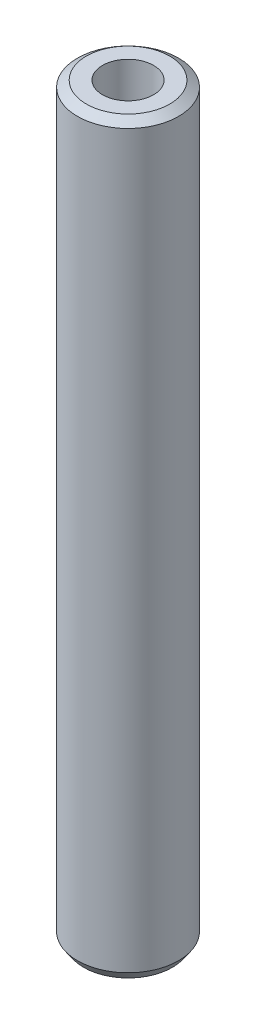
ISO-10303-21;
HEADER;
FILE_DESCRIPTION(('STEP AP214'),'2;1');
FILE_NAME('part.step','',(''),(''),'','','');
FILE_SCHEMA(('AUTOMOTIVE_DESIGN { 1 0 10303 214 1 1 1 1 }'));
ENDSEC;
DATA;
#1=APPLICATION_CONTEXT('core data for automotive mechanical design processes');
#2=APPLICATION_PROTOCOL_DEFINITION('international standard','automotive_design',2000,#1);
#3=PRODUCT_CONTEXT('',#1,'mechanical');
#4=PRODUCT('Part','Part','',(#3));
#5=PRODUCT_RELATED_PRODUCT_CATEGORY('part','',(#4));
#6=PRODUCT_DEFINITION_FORMATION('','',#4);
#7=PRODUCT_DEFINITION_CONTEXT('part definition',#1,'design');
#8=PRODUCT_DEFINITION('design','',#6,#7);
#9=PRODUCT_DEFINITION_SHAPE('','',#8);
#10=(LENGTH_UNIT() NAMED_UNIT(*) SI_UNIT(.MILLI.,.METRE.));
#11=(NAMED_UNIT(*) PLANE_ANGLE_UNIT() SI_UNIT($,.RADIAN.));
#12=(NAMED_UNIT(*) SI_UNIT($,.STERADIAN.) SOLID_ANGLE_UNIT());
#13=UNCERTAINTY_MEASURE_WITH_UNIT(LENGTH_MEASURE(1.E-05),#10,'distance_accuracy_value','');
#14=(GEOMETRIC_REPRESENTATION_CONTEXT(3) GLOBAL_UNCERTAINTY_ASSIGNED_CONTEXT((#13)) GLOBAL_UNIT_ASSIGNED_CONTEXT((#10,
#11,#12)) REPRESENTATION_CONTEXT('',''));
#15=CARTESIAN_POINT('',(0.,0.,0.));
#16=DIRECTION('',(0.,0.,1.));
#17=DIRECTION('',(1.,0.,0.));
#18=AXIS2_PLACEMENT_3D('',#15,#16,#17);
#19=CARTESIAN_POINT('',(0.,73.8165123304939,0.));
#20=DIRECTION('',(0.,-1.,0.));
#21=DIRECTION('',(0.,0.,-1.));
#22=AXIS2_PLACEMENT_3D('',#19,#20,#21);
#23=CYLINDRICAL_SURFACE('',#22,5.);
#24=CARTESIAN_POINT('',(0.,73.2033492976956,0.));
#25=DIRECTION('',(0.,1.,0.));
#26=DIRECTION('',(0.,0.,1.));
#27=AXIS2_PLACEMENT_3D('',#24,#25,#26);
#28=CIRCLE('',#27,5.);
#29=CARTESIAN_POINT('',(0.,73.2033492976956,-5.00000000000001));
#30=VERTEX_POINT('',#29);
#31=EDGE_CURVE('E50',#30,#30,#28,.F.);
#32=ORIENTED_EDGE('',*,*,#31,.T.);
#33=EDGE_LOOP('',(#32));
#34=FACE_BOUND('',#33,.T.);
#35=CARTESIAN_POINT('',(0.,0.881076495948374,0.));
#36=DIRECTION('',(0.,1.,0.));
#37=DIRECTION('',(0.,0.,1.));
#38=AXIS2_PLACEMENT_3D('',#35,#36,#37);
#39=CIRCLE('',#38,5.);
#40=CARTESIAN_POINT('',(0.,0.881076495948374,5.));
#41=VERTEX_POINT('',#40);
#42=EDGE_CURVE('E51',#41,#41,#39,.T.);
#43=ORIENTED_EDGE('',*,*,#42,.T.);
#44=EDGE_LOOP('',(#43));
#45=FACE_BOUND('',#44,.T.);
#46=ADVANCED_FACE('F39',(#34,#45),#23,.T.);
#47=CARTESIAN_POINT('',(0.,73.8165123304939,0.));
#48=DIRECTION('',(0.,1.,0.));
#49=DIRECTION('',(0.,0.,1.));
#50=AXIS2_PLACEMENT_3D('',#47,#48,#49);
#51=PLANE('',#50);
#52=CARTESIAN_POINT('',(0.,73.8165123304939,0.));
#53=DIRECTION('',(0.,1.,0.));
#54=DIRECTION('',(0.,0.,1.));
#55=AXIS2_PLACEMENT_3D('',#52,#53,#54);
#56=CIRCLE('',#55,4.1189235040516);
#57=CARTESIAN_POINT('',(0.,73.8165123304939,-4.11892350405161));
#58=VERTEX_POINT('',#57);
#59=EDGE_CURVE('E54',#58,#58,#56,.T.);
#60=ORIENTED_EDGE('',*,*,#59,.T.);
#61=EDGE_LOOP('',(#60));
#62=FACE_BOUND('',#61,.T.);
#63=CARTESIAN_POINT('',(0.,73.8165123304939,0.));
#64=DIRECTION('',(0.,1.,0.));
#65=DIRECTION('',(0.,0.,1.));
#66=AXIS2_PLACEMENT_3D('',#63,#64,#65);
#67=CIRCLE('',#66,2.52260098917217);
#68=CARTESIAN_POINT('',(0.,73.8165123304939,2.52260098917217));
#69=VERTEX_POINT('',#68);
#70=EDGE_CURVE('E58',#69,#69,#67,.T.);
#71=ORIENTED_EDGE('',*,*,#70,.F.);
#72=EDGE_LOOP('',(#71));
#73=FACE_BOUND('',#72,.T.);
#74=ADVANCED_FACE('F69',(#62,#73),#51,.T.);
#75=CARTESIAN_POINT('',(0.,0.,0.));
#76=DIRECTION('',(0.,1.,0.));
#77=DIRECTION('',(0.,0.,1.));
#78=AXIS2_PLACEMENT_3D('',#75,#76,#77);
#79=PLANE('',#78);
#80=CARTESIAN_POINT('',(0.,0.,0.));
#81=DIRECTION('',(0.,1.,0.));
#82=DIRECTION('',(0.,0.,1.));
#83=AXIS2_PLACEMENT_3D('',#80,#81,#82);
#84=CIRCLE('',#83,4.38683696720161);
#85=CARTESIAN_POINT('',(0.,0.,4.38683696720161));
#86=VERTEX_POINT('',#85);
#87=EDGE_CURVE('E10',#86,#86,#84,.F.);
#88=ORIENTED_EDGE('',*,*,#87,.T.);
#89=EDGE_LOOP('',(#88));
#90=FACE_BOUND('',#89,.T.);
#91=CARTESIAN_POINT('',(0.,0.,0.));
#92=DIRECTION('',(0.,1.,0.));
#93=DIRECTION('',(0.,0.,1.));
#94=AXIS2_PLACEMENT_3D('',#91,#92,#93);
#95=CIRCLE('',#94,2.52260098917217);
#96=CARTESIAN_POINT('',(0.,0.,2.52260098917217));
#97=VERTEX_POINT('',#96);
#98=EDGE_CURVE('E63',#97,#97,#95,.T.);
#99=ORIENTED_EDGE('',*,*,#98,.T.);
#100=EDGE_LOOP('',(#99));
#101=FACE_BOUND('',#100,.T.);
#102=ADVANCED_FACE('F75',(#90,#101),#79,.F.);
#103=CARTESIAN_POINT('',(0.,73.8165123304939,0.));
#104=DIRECTION('',(0.,-1.,0.));
#105=DIRECTION('',(0.,0.,-1.));
#106=AXIS2_PLACEMENT_3D('',#103,#104,#105);
#107=CYLINDRICAL_SURFACE('',#106,2.52260098917217);
#108=ORIENTED_EDGE('',*,*,#70,.T.);
#109=EDGE_LOOP('',(#108));
#110=FACE_BOUND('',#109,.T.);
#111=ORIENTED_EDGE('',*,*,#98,.F.);
#112=EDGE_LOOP('',(#111));
#113=FACE_BOUND('',#112,.T.);
#114=ADVANCED_FACE('F70',(#110,#113),#107,.F.);
#115=CARTESIAN_POINT('',(0.,73.8165123304939,0.));
#116=DIRECTION('',(0.,-1.,0.));
#117=DIRECTION('',(0.,0.,-1.));
#118=AXIS2_PLACEMENT_3D('',#115,#116,#117);
#119=CONICAL_SURFACE('',#118,4.1189235040516,0.962810598294387);
#120=CARTESIAN_POINT('',(0.,73.2033492976956,-5.00000000000001));
#121=CARTESIAN_POINT('',(0.,73.2097364126205,-4.99082211983388));
#122=CARTESIAN_POINT('',(0.,73.2161235275455,-4.98164423966775));
#123=CARTESIAN_POINT('',(0.,73.2288977573955,-4.96328847933549));
#124=CARTESIAN_POINT('',(0.,73.2352848723205,-4.95411059916936));
#125=CARTESIAN_POINT('',(0.,73.2480591021704,-4.93575483883711));
#126=CARTESIAN_POINT('',(0.,73.2544462170954,-4.92657695867098));
#127=CARTESIAN_POINT('',(0.,73.2672204469454,-4.90822119833872));
#128=CARTESIAN_POINT('',(0.,73.2736075618704,-4.89904331817259));
#129=CARTESIAN_POINT('',(0.,73.2863817917203,-4.88068755784033));
#130=CARTESIAN_POINT('',(0.,73.2927689066453,-4.8715096776742));
#131=CARTESIAN_POINT('',(0.,73.3055431364953,-4.85315391734194));
#132=CARTESIAN_POINT('',(0.,73.3119302514203,-4.84397603717581));
#133=CARTESIAN_POINT('',(0.,73.3247044812702,-4.82562027684356));
#134=CARTESIAN_POINT('',(0.,73.3310915961952,-4.81644239667743));
#135=CARTESIAN_POINT('',(0.,73.3438658260452,-4.79808663634517));
#136=CARTESIAN_POINT('',(0.,73.3502529409702,-4.78890875617904));
#137=CARTESIAN_POINT('',(0.,73.3630271708201,-4.77055299584678));
#138=CARTESIAN_POINT('',(0.,73.3694142857451,-4.76137511568065));
#139=CARTESIAN_POINT('',(0.,73.3821885155951,-4.74301935534839));
#140=CARTESIAN_POINT('',(0.,73.3885756305201,-4.73384147518226));
#141=CARTESIAN_POINT('',(0.,73.40134986037,-4.71548571485001));
#142=CARTESIAN_POINT('',(0.,73.407736975295,-4.70630783468388));
#143=CARTESIAN_POINT('',(0.,73.420511205145,-4.68795207435162));
#144=CARTESIAN_POINT('',(0.,73.42689832007,-4.67877419418549));
#145=CARTESIAN_POINT('',(0.,73.4396725499199,-4.66041843385323));
#146=CARTESIAN_POINT('',(0.,73.4460596648449,-4.6512405536871));
#147=CARTESIAN_POINT('',(0.,73.4588338946949,-4.63288479335484));
#148=CARTESIAN_POINT('',(0.,73.4652210096199,-4.62370691318872));
#149=CARTESIAN_POINT('',(0.,73.4779952394698,-4.60535115285646));
#150=CARTESIAN_POINT('',(0.,73.4843823543948,-4.59617327269033));
#151=CARTESIAN_POINT('',(0.,73.4971565842448,-4.57781751235807));
#152=CARTESIAN_POINT('',(0.,73.5035436991698,-4.56863963219194));
#153=CARTESIAN_POINT('',(0.,73.5163179290197,-4.55028387185968));
#154=CARTESIAN_POINT('',(0.,73.5227050439447,-4.54110599169355));
#155=CARTESIAN_POINT('',(0.,73.5354792737947,-4.52275023136129));
#156=CARTESIAN_POINT('',(0.,73.5418663887197,-4.51357235119517));
#157=CARTESIAN_POINT('',(0.,73.5546406185696,-4.49521659086291));
#158=CARTESIAN_POINT('',(0.,73.5610277334946,-4.48603871069678));
#159=CARTESIAN_POINT('',(0.,73.5738019633446,-4.46768295036452));
#160=CARTESIAN_POINT('',(0.,73.5801890782695,-4.45850507019839));
#161=CARTESIAN_POINT('',(0.,73.5929633081195,-4.44014930986613));
#162=CARTESIAN_POINT('',(0.,73.5993504230445,-4.4309714297));
#163=CARTESIAN_POINT('',(0.,73.6121246528945,-4.41261566936774));
#164=CARTESIAN_POINT('',(0.,73.6185117678195,-4.40343778920162));
#165=CARTESIAN_POINT('',(0.,73.6312859976694,-4.38508202886936));
#166=CARTESIAN_POINT('',(0.,73.6376731125944,-4.37590414870323));
#167=CARTESIAN_POINT('',(0.,73.6504473424444,-4.35754838837097));
#168=CARTESIAN_POINT('',(0.,73.6568344573694,-4.34837050820484));
#169=CARTESIAN_POINT('',(0.,73.6696086872193,-4.33001474787258));
#170=CARTESIAN_POINT('',(0.,73.6759958021443,-4.32083686770645));
#171=CARTESIAN_POINT('',(0.,73.6887700319943,-4.3024811073742));
#172=CARTESIAN_POINT('',(0.,73.6951571469193,-4.29330322720807));
#173=CARTESIAN_POINT('',(0.,73.7079313767692,-4.27494746687581));
#174=CARTESIAN_POINT('',(0.,73.7143184916942,-4.26576958670968));
#175=CARTESIAN_POINT('',(0.,73.7270927215442,-4.24741382637742));
#176=CARTESIAN_POINT('',(0.,73.7334798364691,-4.23823594621129));
#177=CARTESIAN_POINT('',(0.,73.7462540663191,-4.21988018587903));
#178=CARTESIAN_POINT('',(0.,73.7526411812441,-4.2107023057129));
#179=CARTESIAN_POINT('',(0.,73.7654154110941,-4.19234654538065));
#180=CARTESIAN_POINT('',(0.,73.771802526019,-4.18316866521452));
#181=CARTESIAN_POINT('',(0.,73.784576755869,-4.16481290488226));
#182=CARTESIAN_POINT('',(0.,73.790963870794,-4.15563502471613));
#183=CARTESIAN_POINT('',(0.,73.803738100644,-4.13727926438387));
#184=CARTESIAN_POINT('',(0.,73.8101252155689,-4.12810138421774));
#185=CARTESIAN_POINT('',(0.,73.8165123304939,-4.11892350405161));
#186=B_SPLINE_CURVE_WITH_KNOTS('',3,(#120,#121,#122,#123,#124,#125,#126,#127,#128,#129,#130,
#131,#132,#133,#134,#135,#136,#137,#138,#139,#140,#141,#142,#143,#144,#145,#146,#147,#148,#149,
#150,#151,#152,#153,#154,#155,#156,#157,#158,#159,#160,#161,#162,#163,#164,#165,#166,#167,#168,
#169,#170,#171,#172,#173,#174,#175,#176,#177,#178,#179,#180,#181,#182,#183,#184,#185),
.UNSPECIFIED.,.F.,.F.,(4,2,2,2,2,2,2,2,2,2,2,2,2,2,2,2,2,2,2,2,2,2,2,2,2,2,2,2,2,2,2,2,4),(0.,
0.033544872822517,0.0670897456450347,0.100634618467552,0.13417949129007,0.167724364112588,
0.201269236935105,0.234814109757623,0.26835898258014,0.301903855402658,0.335448728225176,
0.368993601047701,0.402538473870219,0.436083346692736,0.469628219515254,0.503173092337772,
0.536717965160289,0.570262837982807,0.603807710805325,0.637352583627843,0.67089745645036,
0.704442329272877,0.737987202095403,0.771532074917921,0.805076947740438,0.838621820562956,
0.872166693385473,0.905711566207991,0.939256439030509,0.972801311853027,1.00634618467554,
1.03989105749806,1.07343593032059),.UNSPECIFIED.);
#187=EDGE_CURVE('BSEAM81',#30,#58,#186,.T.);
#188=ORIENTED_EDGE('',*,*,#31,.F.);
#189=ORIENTED_EDGE('',*,*,#59,.F.);
#190=ORIENTED_EDGE('',*,*,#187,.T.);
#191=ORIENTED_EDGE('',*,*,#187,.F.);
#192=EDGE_LOOP('',(#188,#190,#189,#191));
#193=FACE_BOUND('',#192,.T.);
#194=ADVANCED_FACE('F81',(#193),#119,.T.);
#195=CARTESIAN_POINT('',(0.,0.881076495948374,0.));
#196=DIRECTION('',(0.,1.,0.));
#197=DIRECTION('',(0.,0.,1.));
#198=AXIS2_PLACEMENT_3D('',#195,#196,#197);
#199=CONICAL_SURFACE('',#198,5.,0.607985728500524);
#200=ORIENTED_EDGE('',*,*,#87,.F.);
#201=EDGE_LOOP('',(#200));
#202=FACE_BOUND('',#201,.T.);
#203=ORIENTED_EDGE('',*,*,#42,.F.);
#204=EDGE_LOOP('',(#203));
#205=FACE_BOUND('',#204,.T.);
#206=ADVANCED_FACE('F45',(#202,#205),#199,.T.);
#207=CLOSED_SHELL('',(#46,#74,#102,#114,#194,#206));
#208=MANIFOLD_SOLID_BREP('B2',#207);
#209=ADVANCED_BREP_SHAPE_REPRESENTATION('',(#18,#208),#14);
#210=SHAPE_DEFINITION_REPRESENTATION(#9,#209);
ENDSEC;
END-ISO-10303-21;
